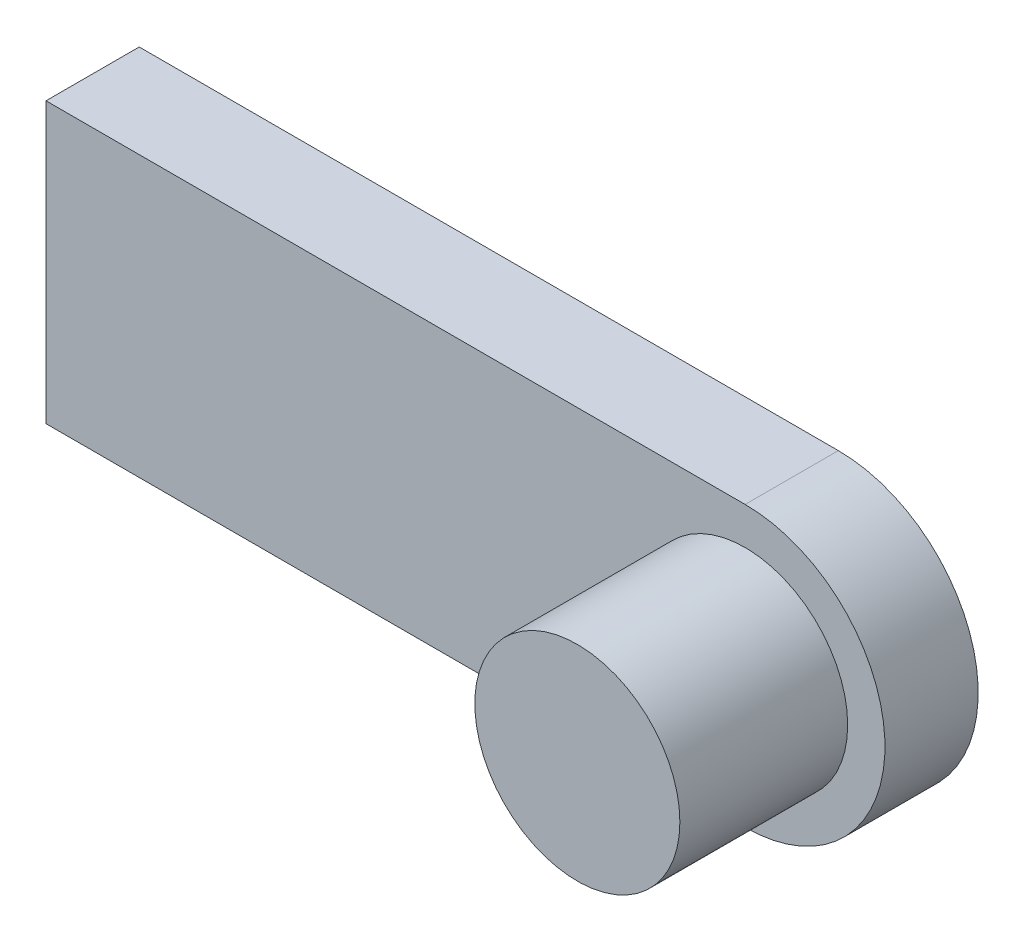
ISO-10303-21;
HEADER;
FILE_DESCRIPTION(('STEP AP214'),'2;1');
FILE_NAME('part.step','',(''),(''),'','','');
FILE_SCHEMA(('AUTOMOTIVE_DESIGN { 1 0 10303 214 1 1 1 1 }'));
ENDSEC;
DATA;
#1=APPLICATION_CONTEXT('core data for automotive mechanical design processes');
#2=APPLICATION_PROTOCOL_DEFINITION('international standard','automotive_design',2000,#1);
#3=PRODUCT_CONTEXT('',#1,'mechanical');
#4=PRODUCT('Part','Part','',(#3));
#5=PRODUCT_RELATED_PRODUCT_CATEGORY('part','',(#4));
#6=PRODUCT_DEFINITION_FORMATION('','',#4);
#7=PRODUCT_DEFINITION_CONTEXT('part definition',#1,'design');
#8=PRODUCT_DEFINITION('design','',#6,#7);
#9=PRODUCT_DEFINITION_SHAPE('','',#8);
#10=(LENGTH_UNIT() NAMED_UNIT(*) SI_UNIT(.MILLI.,.METRE.));
#11=(NAMED_UNIT(*) PLANE_ANGLE_UNIT() SI_UNIT($,.RADIAN.));
#12=(NAMED_UNIT(*) SI_UNIT($,.STERADIAN.) SOLID_ANGLE_UNIT());
#13=UNCERTAINTY_MEASURE_WITH_UNIT(LENGTH_MEASURE(1.E-05),#10,'distance_accuracy_value','');
#14=(GEOMETRIC_REPRESENTATION_CONTEXT(3) GLOBAL_UNCERTAINTY_ASSIGNED_CONTEXT((#13)) GLOBAL_UNIT_ASSIGNED_CONTEXT((#10,
#11,#12)) REPRESENTATION_CONTEXT('',''));
#15=CARTESIAN_POINT('',(0.,0.,0.));
#16=DIRECTION('',(0.,0.,1.));
#17=DIRECTION('',(1.,0.,0.));
#18=AXIS2_PLACEMENT_3D('',#15,#16,#17);
#19=CARTESIAN_POINT('',(0.,0.,0.25));
#20=DIRECTION('',(0.,0.,1.));
#21=DIRECTION('',(0.707106781186548,0.707106781186548,0.));
#22=AXIS2_PLACEMENT_3D('',#19,#20,#21);
#23=PLANE('',#22);
#24=DIRECTION('',(-1.,0.,0.));
#25=VECTOR('',#24,1.);
#26=CARTESIAN_POINT('',(0.925,0.375,0.25));
#27=LINE('',#26,#25);
#28=CARTESIAN_POINT('',(0.925,0.375,0.25));
#29=VERTEX_POINT('',#28);
#30=CARTESIAN_POINT('',(-0.95,0.375,0.25));
#31=VERTEX_POINT('',#30);
#32=EDGE_CURVE('E10',#29,#31,#27,.T.);
#33=ORIENTED_EDGE('',*,*,#32,.T.);
#34=DIRECTION('',(0.,-1.,0.));
#35=VECTOR('',#34,1.);
#36=CARTESIAN_POINT('',(-0.95,0.375,0.25));
#37=LINE('',#36,#35);
#38=CARTESIAN_POINT('',(-0.95,-0.375,0.25));
#39=VERTEX_POINT('',#38);
#40=EDGE_CURVE('E25',#31,#39,#37,.T.);
#41=ORIENTED_EDGE('',*,*,#40,.T.);
#42=DIRECTION('',(1.,0.,0.));
#43=VECTOR('',#42,1.);
#44=CARTESIAN_POINT('',(-0.95,-0.375,0.25));
#45=LINE('',#44,#43);
#46=CARTESIAN_POINT('',(0.925,-0.375,0.25));
#47=VERTEX_POINT('',#46);
#48=EDGE_CURVE('E99',#39,#47,#45,.T.);
#49=ORIENTED_EDGE('',*,*,#48,.T.);
#50=CARTESIAN_POINT('',(0.925,0.,0.25));
#51=DIRECTION('',(0.,0.,1.));
#52=DIRECTION('',(0.,-1.,0.));
#53=AXIS2_PLACEMENT_3D('',#50,#51,#52);
#54=CIRCLE('',#53,0.375);
#55=EDGE_CURVE('E67',#47,#29,#54,.T.);
#56=ORIENTED_EDGE('',*,*,#55,.T.);
#57=EDGE_LOOP('',(#33,#41,#49,#56));
#58=FACE_BOUND('',#57,.T.);
#59=CARTESIAN_POINT('',(0.925,0.,0.25));
#60=DIRECTION('',(0.,0.,1.));
#61=DIRECTION('',(1.,0.,0.));
#62=AXIS2_PLACEMENT_3D('',#59,#60,#61);
#63=CIRCLE('',#62,0.275);
#64=CARTESIAN_POINT('',(1.2,0.,0.25));
#65=VERTEX_POINT('',#64);
#66=EDGE_CURVE('E94',#65,#65,#63,.T.);
#67=ORIENTED_EDGE('',*,*,#66,.F.);
#68=EDGE_LOOP('',(#67));
#69=FACE_BOUND('',#68,.T.);
#70=ADVANCED_FACE('F15',(#58,#69),#23,.T.);
#71=CARTESIAN_POINT('',(0.925,0.,0.25));
#72=DIRECTION('',(0.,0.,1.));
#73=DIRECTION('',(1.,0.,0.));
#74=AXIS2_PLACEMENT_3D('',#71,#72,#73);
#75=CYLINDRICAL_SURFACE('',#74,0.275);
#76=CARTESIAN_POINT('',(0.925,0.,0.7));
#77=DIRECTION('',(0.,0.,1.));
#78=DIRECTION('',(1.,0.,0.));
#79=AXIS2_PLACEMENT_3D('',#76,#77,#78);
#80=CIRCLE('',#79,0.275);
#81=CARTESIAN_POINT('',(1.2,0.,0.7));
#82=VERTEX_POINT('',#81);
#83=EDGE_CURVE('E79',#82,#82,#80,.T.);
#84=ORIENTED_EDGE('',*,*,#83,.F.);
#85=EDGE_LOOP('',(#84));
#86=FACE_BOUND('',#85,.T.);
#87=ORIENTED_EDGE('',*,*,#66,.T.);
#88=EDGE_LOOP('',(#87));
#89=FACE_BOUND('',#88,.T.);
#90=ADVANCED_FACE('F104',(#86,#89),#75,.T.);
#91=CARTESIAN_POINT('',(0.925,0.375,0.));
#92=DIRECTION('',(0.,1.,0.));
#93=DIRECTION('',(0.707106781186548,0.,0.707106781186548));
#94=AXIS2_PLACEMENT_3D('',#91,#92,#93);
#95=PLANE('',#94);
#96=DIRECTION('',(-1.,0.,0.));
#97=VECTOR('',#96,1.);
#98=CARTESIAN_POINT('',(0.925,0.375,0.));
#99=LINE('',#98,#97);
#100=CARTESIAN_POINT('',(0.925,0.375,0.));
#101=VERTEX_POINT('',#100);
#102=CARTESIAN_POINT('',(-0.95,0.375,0.));
#103=VERTEX_POINT('',#102);
#104=EDGE_CURVE('E77',#101,#103,#99,.T.);
#105=ORIENTED_EDGE('',*,*,#104,.T.);
#106=DIRECTION('',(0.,0.,1.));
#107=VECTOR('',#106,1.);
#108=CARTESIAN_POINT('',(-0.95,0.375,0.));
#109=LINE('',#108,#107);
#110=EDGE_CURVE('E85',#103,#31,#109,.T.);
#111=ORIENTED_EDGE('',*,*,#110,.T.);
#112=ORIENTED_EDGE('',*,*,#32,.F.);
#113=DIRECTION('',(0.,0.,1.));
#114=VECTOR('',#113,1.);
#115=CARTESIAN_POINT('',(0.925,0.375,0.));
#116=LINE('',#115,#114);
#117=EDGE_CURVE('E78',#101,#29,#116,.T.);
#118=ORIENTED_EDGE('',*,*,#117,.F.);
#119=EDGE_LOOP('',(#105,#111,#112,#118));
#120=FACE_BOUND('',#119,.T.);
#121=ADVANCED_FACE('F93',(#120),#95,.T.);
#122=CARTESIAN_POINT('',(-0.95,0.375,0.));
#123=DIRECTION('',(-1.,0.,0.));
#124=DIRECTION('',(0.,0.707106781186548,0.707106781186548));
#125=AXIS2_PLACEMENT_3D('',#122,#123,#124);
#126=PLANE('',#125);
#127=DIRECTION('',(0.,-1.,0.));
#128=VECTOR('',#127,1.);
#129=CARTESIAN_POINT('',(-0.95,0.375,0.));
#130=LINE('',#129,#128);
#131=CARTESIAN_POINT('',(-0.95,-0.375,0.));
#132=VERTEX_POINT('',#131);
#133=EDGE_CURVE('E87',#103,#132,#130,.T.);
#134=ORIENTED_EDGE('',*,*,#133,.T.);
#135=DIRECTION('',(0.,0.,1.));
#136=VECTOR('',#135,1.);
#137=CARTESIAN_POINT('',(-0.95,-0.375,0.));
#138=LINE('',#137,#136);
#139=EDGE_CURVE('E56',#132,#39,#138,.T.);
#140=ORIENTED_EDGE('',*,*,#139,.T.);
#141=ORIENTED_EDGE('',*,*,#40,.F.);
#142=ORIENTED_EDGE('',*,*,#110,.F.);
#143=EDGE_LOOP('',(#134,#140,#141,#142));
#144=FACE_BOUND('',#143,.T.);
#145=ADVANCED_FACE('F89',(#144),#126,.T.);
#146=CARTESIAN_POINT('',(-0.95,-0.375,0.));
#147=DIRECTION('',(0.,-1.,0.));
#148=DIRECTION('',(0.707106781186548,0.,0.707106781186548));
#149=AXIS2_PLACEMENT_3D('',#146,#147,#148);
#150=PLANE('',#149);
#151=DIRECTION('',(1.,0.,0.));
#152=VECTOR('',#151,1.);
#153=CARTESIAN_POINT('',(-0.95,-0.375,0.));
#154=LINE('',#153,#152);
#155=CARTESIAN_POINT('',(0.925,-0.375,0.));
#156=VERTEX_POINT('',#155);
#157=EDGE_CURVE('E69',#132,#156,#154,.T.);
#158=ORIENTED_EDGE('',*,*,#157,.T.);
#159=DIRECTION('',(0.,0.,1.));
#160=VECTOR('',#159,1.);
#161=CARTESIAN_POINT('',(0.925,-0.375,0.));
#162=LINE('',#161,#160);
#163=EDGE_CURVE('E62',#156,#47,#162,.T.);
#164=ORIENTED_EDGE('',*,*,#163,.T.);
#165=ORIENTED_EDGE('',*,*,#48,.F.);
#166=ORIENTED_EDGE('',*,*,#139,.F.);
#167=EDGE_LOOP('',(#158,#164,#165,#166));
#168=FACE_BOUND('',#167,.T.);
#169=ADVANCED_FACE('F71',(#168),#150,.T.);
#170=CARTESIAN_POINT('',(0.925,0.,0.));
#171=DIRECTION('',(0.,0.,1.));
#172=DIRECTION('',(0.,-1.,0.));
#173=AXIS2_PLACEMENT_3D('',#170,#171,#172);
#174=CYLINDRICAL_SURFACE('',#173,0.375);
#175=CARTESIAN_POINT('',(0.925,0.,0.));
#176=DIRECTION('',(0.,0.,1.));
#177=DIRECTION('',(0.,-1.,0.));
#178=AXIS2_PLACEMENT_3D('',#175,#176,#177);
#179=CIRCLE('',#178,0.375);
#180=EDGE_CURVE('E19',#156,#101,#179,.T.);
#181=ORIENTED_EDGE('',*,*,#180,.T.);
#182=ORIENTED_EDGE('',*,*,#117,.T.);
#183=ORIENTED_EDGE('',*,*,#55,.F.);
#184=ORIENTED_EDGE('',*,*,#163,.F.);
#185=EDGE_LOOP('',(#181,#182,#183,#184));
#186=FACE_BOUND('',#185,.T.);
#187=ADVANCED_FACE('F63',(#186),#174,.T.);
#188=CARTESIAN_POINT('',(1.8,0.,0.7));
#189=DIRECTION('',(0.,0.,-1.));
#190=DIRECTION('',(0.707106781186548,0.707106781186548,0.));
#191=AXIS2_PLACEMENT_3D('',#188,#189,#190);
#192=PLANE('',#191);
#193=ORIENTED_EDGE('',*,*,#83,.T.);
#194=EDGE_LOOP('',(#193));
#195=FACE_BOUND('',#194,.T.);
#196=ADVANCED_FACE('F121',(#195),#192,.F.);
#197=CARTESIAN_POINT('',(0.,0.,0.));
#198=DIRECTION('',(0.,0.,1.));
#199=DIRECTION('',(0.707106781186548,0.707106781186548,0.));
#200=AXIS2_PLACEMENT_3D('',#197,#198,#199);
#201=PLANE('',#200);
#202=ORIENTED_EDGE('',*,*,#180,.F.);
#203=ORIENTED_EDGE('',*,*,#157,.F.);
#204=ORIENTED_EDGE('',*,*,#133,.F.);
#205=ORIENTED_EDGE('',*,*,#104,.F.);
#206=EDGE_LOOP('',(#202,#203,#204,#205));
#207=FACE_BOUND('',#206,.T.);
#208=ADVANCED_FACE('F17',(#207),#201,.F.);
#209=CLOSED_SHELL('',(#70,#90,#121,#145,#169,#187,#196,#208));
#210=MANIFOLD_SOLID_BREP('B1',#209);
#211=ADVANCED_BREP_SHAPE_REPRESENTATION('',(#18,#210),#14);
#212=SHAPE_DEFINITION_REPRESENTATION(#9,#211);
ENDSEC;
END-ISO-10303-21;
